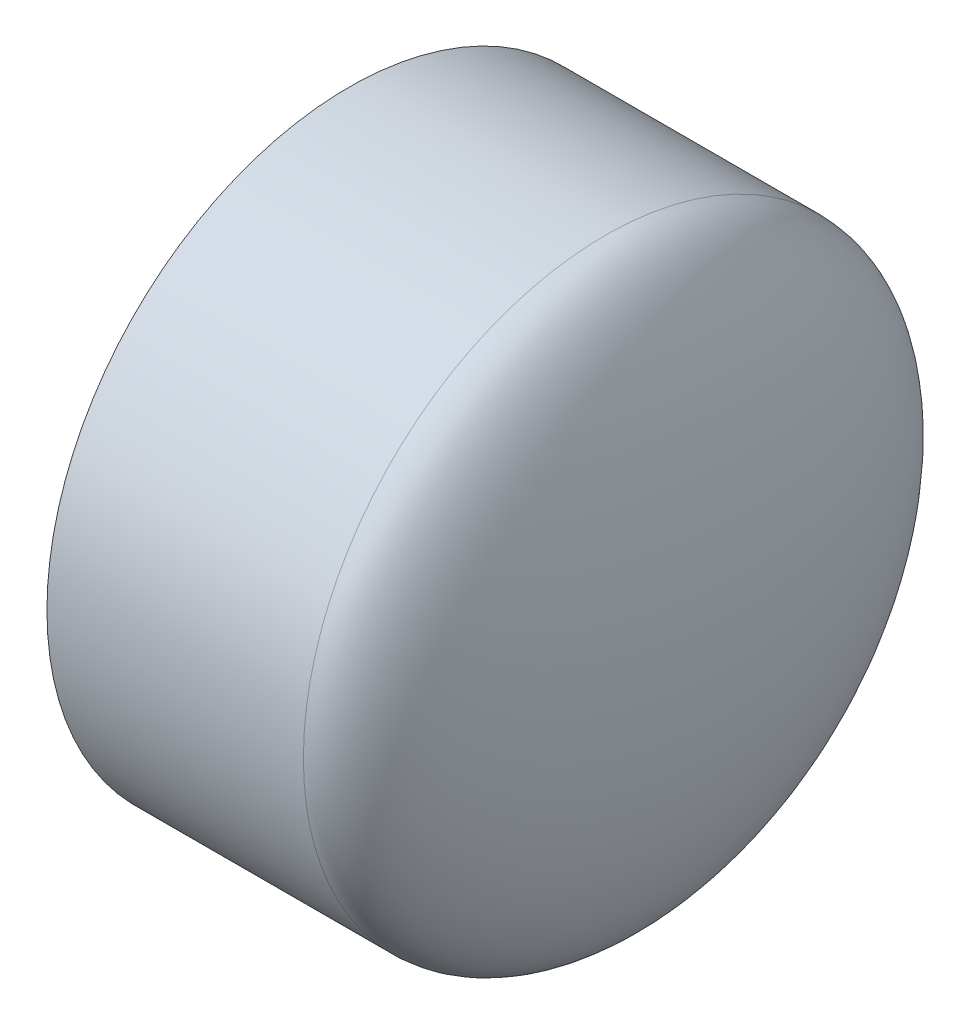
ISO-10303-21;
HEADER;
FILE_DESCRIPTION(('STEP AP214'),'2;1');
FILE_NAME('part.step','',(''),(''),'','','');
FILE_SCHEMA(('AUTOMOTIVE_DESIGN { 1 0 10303 214 1 1 1 1 }'));
ENDSEC;
DATA;
#1=APPLICATION_CONTEXT('core data for automotive mechanical design processes');
#2=APPLICATION_PROTOCOL_DEFINITION('international standard','automotive_design',2000,#1);
#3=PRODUCT_CONTEXT('',#1,'mechanical');
#4=PRODUCT('Part','Part','',(#3));
#5=PRODUCT_RELATED_PRODUCT_CATEGORY('part','',(#4));
#6=PRODUCT_DEFINITION_FORMATION('','',#4);
#7=PRODUCT_DEFINITION_CONTEXT('part definition',#1,'design');
#8=PRODUCT_DEFINITION('design','',#6,#7);
#9=PRODUCT_DEFINITION_SHAPE('','',#8);
#10=(LENGTH_UNIT() NAMED_UNIT(*) SI_UNIT(.MILLI.,.METRE.));
#11=(NAMED_UNIT(*) PLANE_ANGLE_UNIT() SI_UNIT($,.RADIAN.));
#12=(NAMED_UNIT(*) SI_UNIT($,.STERADIAN.) SOLID_ANGLE_UNIT());
#13=UNCERTAINTY_MEASURE_WITH_UNIT(LENGTH_MEASURE(1.E-05),#10,'distance_accuracy_value','');
#14=(GEOMETRIC_REPRESENTATION_CONTEXT(3) GLOBAL_UNCERTAINTY_ASSIGNED_CONTEXT((#13)) GLOBAL_UNIT_ASSIGNED_CONTEXT((#10,
#11,#12)) REPRESENTATION_CONTEXT('',''));
#15=CARTESIAN_POINT('',(0.,0.,0.));
#16=DIRECTION('',(0.,0.,1.));
#17=DIRECTION('',(1.,0.,0.));
#18=AXIS2_PLACEMENT_3D('',#15,#16,#17);
#19=CARTESIAN_POINT('',(-22.0472,0.,0.));
#20=DIRECTION('',(0.,0.,1.));
#21=DIRECTION('',(0.,1.,0.));
#22=AXIS2_PLACEMENT_3D('',#19,#20,#21);
#23=ELLIPSE('',#22,67.31,22.0472);
#24=TRIMMED_CURVE('',#23,(PARAMETER_VALUE(1.5707963267949)),(PARAMETER_VALUE(4.71238898038469)),
.T.,.PARAMETER.);
#25=CARTESIAN_POINT('',(-79.1972,0.,0.));
#26=DIRECTION('',(-1.,0.,0.));
#27=AXIS1_PLACEMENT('',#25,#26);
#28=SURFACE_OF_REVOLUTION('',#24,#27);
#29=CARTESIAN_POINT('',(0.,0.,0.));
#30=VERTEX_POINT('',#29);
#31=VERTEX_LOOP('',#30);
#32=FACE_BOUND('',#31,.T.);
#33=CARTESIAN_POINT('',(-22.0472,0.,0.));
#34=DIRECTION('',(-1.,0.,0.));
#35=DIRECTION('',(0.,0.,1.));
#36=AXIS2_PLACEMENT_3D('',#33,#34,#35);
#37=CIRCLE('',#36,67.31);
#38=CARTESIAN_POINT('',(-22.0472,0.,67.31));
#39=VERTEX_POINT('',#38);
#40=EDGE_CURVE('E51',#39,#39,#37,.T.);
#41=ORIENTED_EDGE('',*,*,#40,.F.);
#42=EDGE_LOOP('',(#41));
#43=FACE_BOUND('',#42,.T.);
#44=ADVANCED_FACE('F32',(#32,#43),#28,.F.);
#45=CARTESIAN_POINT('',(-22.0472,0.,0.));
#46=DIRECTION('',(0.,0.,-1.));
#47=DIRECTION('',(0.,-1.,0.));
#48=AXIS2_PLACEMENT_3D('',#45,#46,#47);
#49=ELLIPSE('',#48,57.0357,11.7729);
#50=TRIMMED_CURVE('',#49,(PARAMETER_VALUE(4.71238898038469)),
(PARAMETER_VALUE(7.85398163397448)),.T.,.PARAMETER.);
#51=CARTESIAN_POINT('',(-79.1972,0.,0.));
#52=DIRECTION('',(-1.,0.,0.));
#53=AXIS1_PLACEMENT('',#51,#52);
#54=SURFACE_OF_REVOLUTION('',#50,#53);
#55=CARTESIAN_POINT('',(-22.0472,0.,0.));
#56=DIRECTION('',(-1.,0.,0.));
#57=DIRECTION('',(0.,0.,1.));
#58=AXIS2_PLACEMENT_3D('',#55,#56,#57);
#59=CIRCLE('',#58,57.0357);
#60=CARTESIAN_POINT('',(-22.0472,0.,57.0357));
#61=VERTEX_POINT('',#60);
#62=EDGE_CURVE('E11',#61,#61,#59,.T.);
#63=ORIENTED_EDGE('',*,*,#62,.T.);
#64=EDGE_LOOP('',(#63));
#65=FACE_BOUND('',#64,.T.);
#66=CARTESIAN_POINT('',(-10.2743,0.,0.));
#67=VERTEX_POINT('',#66);
#68=VERTEX_LOOP('',#67);
#69=FACE_BOUND('',#68,.T.);
#70=ADVANCED_FACE('F48',(#65,#69),#54,.F.);
#71=CARTESIAN_POINT('',(-22.0472,0.,0.));
#72=DIRECTION('',(-1.,0.,0.));
#73=DIRECTION('',(0.,0.,1.));
#74=AXIS2_PLACEMENT_3D('',#71,#72,#73);
#75=CONICAL_SURFACE('',#74,57.0357,0.00599992800155516);
#76=CARTESIAN_POINT('',(-79.1972,0.,0.));
#77=DIRECTION('',(-1.,0.,0.));
#78=DIRECTION('',(0.,0.,1.));
#79=AXIS2_PLACEMENT_3D('',#76,#77,#78);
#80=CIRCLE('',#79,57.3786);
#81=CARTESIAN_POINT('',(-79.1972,0.,57.3786));
#82=VERTEX_POINT('',#81);
#83=EDGE_CURVE('E40',#82,#82,#80,.T.);
#84=ORIENTED_EDGE('',*,*,#83,.T.);
#85=EDGE_LOOP('',(#84));
#86=FACE_BOUND('',#85,.T.);
#87=ORIENTED_EDGE('',*,*,#62,.F.);
#88=EDGE_LOOP('',(#87));
#89=FACE_BOUND('',#88,.T.);
#90=ADVANCED_FACE('F62',(#86,#89),#75,.F.);
#91=CARTESIAN_POINT('',(-79.1972,-67.31,0.));
#92=DIRECTION('',(-1.,0.,0.));
#93=DIRECTION('',(0.,0.,1.));
#94=AXIS2_PLACEMENT_3D('',#91,#92,#93);
#95=PLANE('',#94);
#96=CARTESIAN_POINT('',(-79.1972,0.,0.));
#97=DIRECTION('',(-1.,0.,0.));
#98=DIRECTION('',(0.,0.,1.));
#99=AXIS2_PLACEMENT_3D('',#96,#97,#98);
#100=CIRCLE('',#99,67.31);
#101=CARTESIAN_POINT('',(-79.1972,0.,67.31));
#102=VERTEX_POINT('',#101);
#103=EDGE_CURVE('E53',#102,#102,#100,.T.);
#104=ORIENTED_EDGE('',*,*,#103,.T.);
#105=EDGE_LOOP('',(#104));
#106=FACE_BOUND('',#105,.T.);
#107=ORIENTED_EDGE('',*,*,#83,.F.);
#108=EDGE_LOOP('',(#107));
#109=FACE_BOUND('',#108,.T.);
#110=ADVANCED_FACE('F65',(#106,#109),#95,.T.);
#111=CARTESIAN_POINT('',(-79.1972,0.,0.));
#112=DIRECTION('',(-1.,0.,0.));
#113=DIRECTION('',(0.,0.,1.));
#114=AXIS2_PLACEMENT_3D('',#111,#112,#113);
#115=CYLINDRICAL_SURFACE('',#114,67.31);
#116=ORIENTED_EDGE('',*,*,#40,.T.);
#117=EDGE_LOOP('',(#116));
#118=FACE_BOUND('',#117,.T.);
#119=ORIENTED_EDGE('',*,*,#103,.F.);
#120=EDGE_LOOP('',(#119));
#121=FACE_BOUND('',#120,.T.);
#122=ADVANCED_FACE('F67',(#118,#121),#115,.T.);
#123=CLOSED_SHELL('',(#44,#70,#90,#110,#122));
#124=MANIFOLD_SOLID_BREP('B2',#123);
#125=ADVANCED_BREP_SHAPE_REPRESENTATION('',(#18,#124),#14);
#126=SHAPE_DEFINITION_REPRESENTATION(#9,#125);
ENDSEC;
END-ISO-10303-21;
